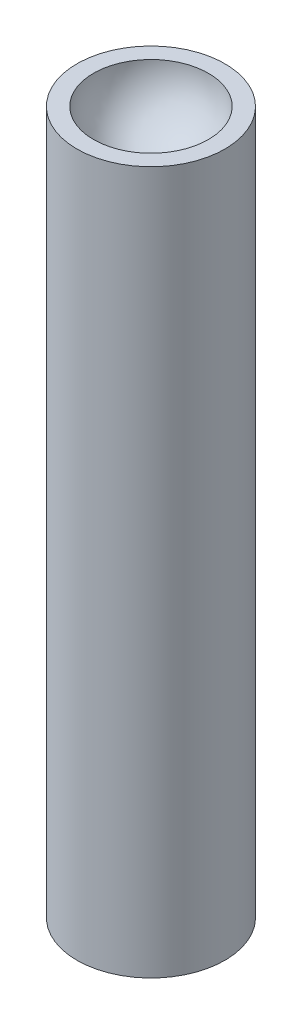
ISO-10303-21;
HEADER;
FILE_DESCRIPTION(('STEP AP214'),'2;1');
FILE_NAME('part.step','',(''),(''),'','','');
FILE_SCHEMA(('AUTOMOTIVE_DESIGN { 1 0 10303 214 1 1 1 1 }'));
ENDSEC;
DATA;
#1=APPLICATION_CONTEXT('core data for automotive mechanical design processes');
#2=APPLICATION_PROTOCOL_DEFINITION('international standard','automotive_design',2000,#1);
#3=PRODUCT_CONTEXT('',#1,'mechanical');
#4=PRODUCT('Part','Part','',(#3));
#5=PRODUCT_RELATED_PRODUCT_CATEGORY('part','',(#4));
#6=PRODUCT_DEFINITION_FORMATION('','',#4);
#7=PRODUCT_DEFINITION_CONTEXT('part definition',#1,'design');
#8=PRODUCT_DEFINITION('design','',#6,#7);
#9=PRODUCT_DEFINITION_SHAPE('','',#8);
#10=(LENGTH_UNIT() NAMED_UNIT(*) SI_UNIT(.MILLI.,.METRE.));
#11=(NAMED_UNIT(*) PLANE_ANGLE_UNIT() SI_UNIT($,.RADIAN.));
#12=(NAMED_UNIT(*) SI_UNIT($,.STERADIAN.) SOLID_ANGLE_UNIT());
#13=UNCERTAINTY_MEASURE_WITH_UNIT(LENGTH_MEASURE(1.E-05),#10,'distance_accuracy_value','');
#14=(GEOMETRIC_REPRESENTATION_CONTEXT(3) GLOBAL_UNCERTAINTY_ASSIGNED_CONTEXT((#13)) GLOBAL_UNIT_ASSIGNED_CONTEXT((#10,
#11,#12)) REPRESENTATION_CONTEXT('',''));
#15=CARTESIAN_POINT('',(0.,0.,0.));
#16=DIRECTION('',(0.,0.,1.));
#17=DIRECTION('',(1.,0.,0.));
#18=AXIS2_PLACEMENT_3D('',#15,#16,#17);
#19=CARTESIAN_POINT('',(0.,19.,0.));
#20=DIRECTION('',(0.,-1.,0.));
#21=DIRECTION('',(0.,0.,-1.));
#22=AXIS2_PLACEMENT_3D('',#19,#20,#21);
#23=CYLINDRICAL_SURFACE('',#22,2.);
#24=CARTESIAN_POINT('',(0.,19.,0.));
#25=DIRECTION('',(0.,1.,0.));
#26=DIRECTION('',(0.,0.,1.));
#27=AXIS2_PLACEMENT_3D('',#24,#25,#26);
#28=CIRCLE('',#27,2.);
#29=CARTESIAN_POINT('',(0.,19.,2.));
#30=VERTEX_POINT('',#29);
#31=EDGE_CURVE('E10',#30,#30,#28,.T.);
#32=ORIENTED_EDGE('',*,*,#31,.F.);
#33=EDGE_LOOP('',(#32));
#34=FACE_BOUND('',#33,.T.);
#35=CARTESIAN_POINT('',(0.,0.,0.));
#36=DIRECTION('',(0.,1.,0.));
#37=DIRECTION('',(0.,0.,1.));
#38=AXIS2_PLACEMENT_3D('',#35,#36,#37);
#39=CIRCLE('',#38,2.);
#40=CARTESIAN_POINT('',(0.,0.,2.));
#41=VERTEX_POINT('',#40);
#42=EDGE_CURVE('E38',#41,#41,#39,.T.);
#43=ORIENTED_EDGE('',*,*,#42,.T.);
#44=EDGE_LOOP('',(#43));
#45=FACE_BOUND('',#44,.T.);
#46=ADVANCED_FACE('F31',(#34,#45),#23,.T.);
#47=CARTESIAN_POINT('',(0.,19.,0.));
#48=DIRECTION('',(0.,1.,0.));
#49=DIRECTION('',(0.,0.,1.));
#50=AXIS2_PLACEMENT_3D('',#47,#48,#49);
#51=PLANE('',#50);
#52=CARTESIAN_POINT('',(0.,19.,0.));
#53=DIRECTION('',(0.,1.,0.));
#54=DIRECTION('',(0.,0.,1.));
#55=AXIS2_PLACEMENT_3D('',#52,#53,#54);
#56=CIRCLE('',#55,1.55346728738253);
#57=CARTESIAN_POINT('',(0.,19.,1.55346728738253));
#58=VERTEX_POINT('',#57);
#59=EDGE_CURVE('E34',#58,#58,#56,.T.);
#60=ORIENTED_EDGE('',*,*,#59,.F.);
#61=EDGE_LOOP('',(#60));
#62=FACE_BOUND('',#61,.T.);
#63=ORIENTED_EDGE('',*,*,#31,.T.);
#64=EDGE_LOOP('',(#63));
#65=FACE_BOUND('',#64,.T.);
#66=ADVANCED_FACE('F50',(#62,#65),#51,.T.);
#67=CARTESIAN_POINT('',(0.,0.,0.));
#68=DIRECTION('',(0.,1.,0.));
#69=DIRECTION('',(0.,0.,1.));
#70=AXIS2_PLACEMENT_3D('',#67,#68,#69);
#71=PLANE('',#70);
#72=ORIENTED_EDGE('',*,*,#42,.F.);
#73=EDGE_LOOP('',(#72));
#74=FACE_BOUND('',#73,.T.);
#75=ADVANCED_FACE('F52',(#74),#71,.F.);
#76=CARTESIAN_POINT('',(0.,19.,0.));
#77=DIRECTION('',(0.,0.,-1.));
#78=DIRECTION('',(1.,0.,0.));
#79=AXIS2_PLACEMENT_3D('',#76,#77,#78);
#80=SPHERICAL_SURFACE('',#79,1.55346728738253);
#81=CARTESIAN_POINT('',(0.,19.,0.));
#82=DIRECTION('',(0.,1.,0.));
#83=DIRECTION('',(0.,0.,1.));
#84=AXIS2_PLACEMENT_3D('',#81,#82,#83);
#85=SPHERICAL_SURFACE('',#84,1.55346728738253);
#86=ORIENTED_EDGE('',*,*,#59,.T.);
#87=EDGE_LOOP('',(#86));
#88=FACE_BOUND('',#87,.T.);
#89=ADVANCED_FACE('F48',(#88),#85,.F.);
#90=CLOSED_SHELL('',(#46,#66,#75,#89));
#91=MANIFOLD_SOLID_BREP('B2',#90);
#92=ADVANCED_BREP_SHAPE_REPRESENTATION('',(#18,#91),#14);
#93=SHAPE_DEFINITION_REPRESENTATION(#9,#92);
ENDSEC;
END-ISO-10303-21;
